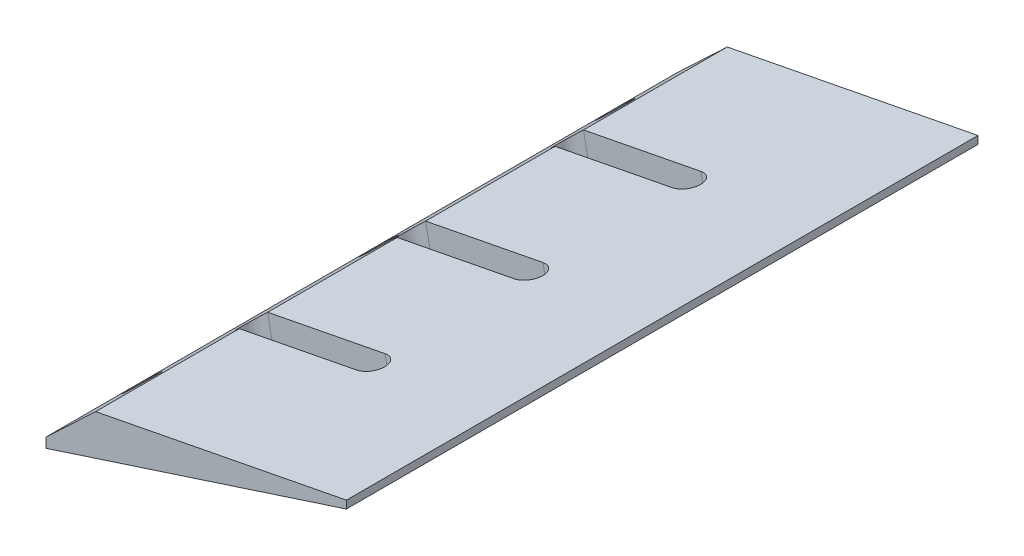
ISO-10303-21;
HEADER;
FILE_DESCRIPTION(('STEP AP214'),'2;1');
FILE_NAME('part.step','',(''),(''),'','','');
FILE_SCHEMA(('AUTOMOTIVE_DESIGN { 1 0 10303 214 1 1 1 1 }'));
ENDSEC;
DATA;
#1=APPLICATION_CONTEXT('core data for automotive mechanical design processes');
#2=APPLICATION_PROTOCOL_DEFINITION('international standard','automotive_design',2000,#1);
#3=PRODUCT_CONTEXT('',#1,'mechanical');
#4=PRODUCT('Part','Part','',(#3));
#5=PRODUCT_RELATED_PRODUCT_CATEGORY('part','',(#4));
#6=PRODUCT_DEFINITION_FORMATION('','',#4);
#7=PRODUCT_DEFINITION_CONTEXT('part definition',#1,'design');
#8=PRODUCT_DEFINITION('design','',#6,#7);
#9=PRODUCT_DEFINITION_SHAPE('','',#8);
#10=(LENGTH_UNIT() NAMED_UNIT(*) SI_UNIT(.MILLI.,.METRE.));
#11=(NAMED_UNIT(*) PLANE_ANGLE_UNIT() SI_UNIT($,.RADIAN.));
#12=(NAMED_UNIT(*) SI_UNIT($,.STERADIAN.) SOLID_ANGLE_UNIT());
#13=UNCERTAINTY_MEASURE_WITH_UNIT(LENGTH_MEASURE(1.E-05),#10,'distance_accuracy_value','');
#14=(GEOMETRIC_REPRESENTATION_CONTEXT(3) GLOBAL_UNCERTAINTY_ASSIGNED_CONTEXT((#13)) GLOBAL_UNIT_ASSIGNED_CONTEXT((#10,
#11,#12)) REPRESENTATION_CONTEXT('',''));
#15=CARTESIAN_POINT('',(0.,0.,0.));
#16=DIRECTION('',(0.,0.,1.));
#17=DIRECTION('',(1.,0.,0.));
#18=AXIS2_PLACEMENT_3D('',#15,#16,#17);
#19=CARTESIAN_POINT('',(-76.2297436243775,-55.6702445798386,140.));
#20=DIRECTION('',(-0.309016994374941,0.951056516295156,0.));
#21=DIRECTION('',(-0.951056516295156,-0.309016994374941,0.));
#22=AXIS2_PLACEMENT_3D('',#19,#20,#21);
#23=CYLINDRICAL_SURFACE('',#22,1.5);
#24=CARTESIAN_POINT('',(-85.3115252244442,-27.7193948610917,140.));
#25=DIRECTION('',(-0.309016994374941,0.951056516295156,0.));
#26=DIRECTION('',(-0.951056516295156,-0.309016994374941,0.));
#27=AXIS2_PLACEMENT_3D('',#24,#25,#26);
#28=CIRCLE('',#27,1.5);
#29=CARTESIAN_POINT('',(-86.7381099988869,-28.1829203526541,140.));
#30=VERTEX_POINT('',#29);
#31=EDGE_CURVE('E226',#30,#30,#28,.T.);
#32=ORIENTED_EDGE('',*,*,#31,.F.);
#33=EDGE_LOOP('',(#32));
#34=FACE_BOUND('',#33,.T.);
#35=CARTESIAN_POINT('',(-85.9295592131941,-25.8172818285014,140.));
#36=DIRECTION('',(-0.309016994374941,0.951056516295156,0.));
#37=DIRECTION('',(-0.951056516295156,-0.309016994374941,0.));
#38=AXIS2_PLACEMENT_3D('',#35,#36,#37);
#39=CIRCLE('',#38,1.5);
#40=CARTESIAN_POINT('',(-87.3561439876368,-26.2808073200638,140.));
#41=VERTEX_POINT('',#40);
#42=EDGE_CURVE('E210',#41,#41,#39,.F.);
#43=ORIENTED_EDGE('',*,*,#42,.F.);
#44=EDGE_LOOP('',(#43));
#45=FACE_BOUND('',#44,.T.);
#46=ADVANCED_FACE('F40',(#34,#45),#23,.F.);
#47=CARTESIAN_POINT('',(-76.2297436243767,-55.6702445798384,80.));
#48=DIRECTION('',(-0.309016994374941,0.951056516295156,0.));
#49=DIRECTION('',(-0.951056516295156,-0.309016994374941,0.));
#50=AXIS2_PLACEMENT_3D('',#47,#48,#49);
#51=CYLINDRICAL_SURFACE('',#50,1.5);
#52=CARTESIAN_POINT('',(-85.3115252244433,-27.7193948610914,80.));
#53=DIRECTION('',(-0.309016994374941,0.951056516295156,0.));
#54=DIRECTION('',(-0.951056516295156,-0.309016994374941,0.));
#55=AXIS2_PLACEMENT_3D('',#52,#53,#54);
#56=CIRCLE('',#55,1.5);
#57=CARTESIAN_POINT('',(-86.738109998886,-28.1829203526538,80.));
#58=VERTEX_POINT('',#57);
#59=EDGE_CURVE('E186',#58,#58,#56,.T.);
#60=ORIENTED_EDGE('',*,*,#59,.F.);
#61=EDGE_LOOP('',(#60));
#62=FACE_BOUND('',#61,.T.);
#63=CARTESIAN_POINT('',(-85.9295592131932,-25.8172818285011,80.));
#64=DIRECTION('',(-0.309016994374941,0.951056516295156,0.));
#65=DIRECTION('',(-0.951056516295156,-0.309016994374941,0.));
#66=AXIS2_PLACEMENT_3D('',#63,#64,#65);
#67=CIRCLE('',#66,1.5);
#68=CARTESIAN_POINT('',(-87.3561439876359,-26.2808073200635,80.));
#69=VERTEX_POINT('',#68);
#70=EDGE_CURVE('E205',#69,#69,#67,.F.);
#71=ORIENTED_EDGE('',*,*,#70,.F.);
#72=EDGE_LOOP('',(#71));
#73=FACE_BOUND('',#72,.T.);
#74=ADVANCED_FACE('F467',(#62,#73),#51,.F.);
#75=CARTESIAN_POINT('',(-76.2297436243775,-55.6702445798386,20.));
#76=DIRECTION('',(-0.309016994374941,0.951056516295156,0.));
#77=DIRECTION('',(-0.951056516295156,-0.309016994374941,0.));
#78=AXIS2_PLACEMENT_3D('',#75,#76,#77);
#79=CYLINDRICAL_SURFACE('',#78,1.5);
#80=CARTESIAN_POINT('',(-85.3115252244442,-27.7193948610917,20.));
#81=DIRECTION('',(-0.309016994374941,0.951056516295156,0.));
#82=DIRECTION('',(-0.951056516295156,-0.309016994374941,0.));
#83=AXIS2_PLACEMENT_3D('',#80,#81,#82);
#84=CIRCLE('',#83,1.5);
#85=CARTESIAN_POINT('',(-86.7381099988869,-28.1829203526541,20.));
#86=VERTEX_POINT('',#85);
#87=EDGE_CURVE('E179',#86,#86,#84,.T.);
#88=ORIENTED_EDGE('',*,*,#87,.F.);
#89=EDGE_LOOP('',(#88));
#90=FACE_BOUND('',#89,.T.);
#91=CARTESIAN_POINT('',(-85.9295592131941,-25.8172818285014,20.));
#92=DIRECTION('',(-0.309016994374941,0.951056516295156,0.));
#93=DIRECTION('',(-0.951056516295156,-0.309016994374941,0.));
#94=AXIS2_PLACEMENT_3D('',#91,#92,#93);
#95=CIRCLE('',#94,1.5);
#96=CARTESIAN_POINT('',(-87.3561439876368,-26.2808073200638,20.));
#97=VERTEX_POINT('',#96);
#98=EDGE_CURVE('E201',#97,#97,#95,.F.);
#99=ORIENTED_EDGE('',*,*,#98,.F.);
#100=EDGE_LOOP('',(#99));
#101=FACE_BOUND('',#100,.T.);
#102=ADVANCED_FACE('F462',(#90,#101),#79,.F.);
#103=CARTESIAN_POINT('',(0.,0.,160.));
#104=DIRECTION('',(-0.309016994374941,0.951056516295156,0.));
#105=DIRECTION('',(-0.951056516295156,-0.309016994374941,0.));
#106=AXIS2_PLACEMENT_3D('',#103,#104,#105);
#107=PLANE('',#106);
#108=DIRECTION('',(0.951056516295156,0.309016994374941,0.));
#109=VECTOR('',#108,1.);
#110=CARTESIAN_POINT('',(0.,0.,123.6));
#111=LINE('',#110,#109);
#112=CARTESIAN_POINT('',(-76.6559027787226,-24.9070126453212,123.6));
#113=VERTEX_POINT('',#112);
#114=CARTESIAN_POINT('',(-47.6424429134042,-15.4799680792165,123.6));
#115=VERTEX_POINT('',#114);
#116=EDGE_CURVE('E359',#113,#115,#111,.T.);
#117=ORIENTED_EDGE('',*,*,#116,.T.);
#118=CARTESIAN_POINT('',(-47.6424429134042,-15.4799680792165,120.));
#119=DIRECTION('',(-0.309016994374941,0.951056516295156,0.));
#120=DIRECTION('',(0.951056516295156,0.309016994374941,0.));
#121=AXIS2_PLACEMENT_3D('',#118,#119,#120);
#122=ELLIPSE('',#121,3.62703537165186,3.60000000000001);
#123=CARTESIAN_POINT('',(-47.6424429134042,-15.4799680792165,116.4));
#124=VERTEX_POINT('',#123);
#125=EDGE_CURVE('E371',#115,#124,#122,.T.);
#126=ORIENTED_EDGE('',*,*,#125,.T.);
#127=DIRECTION('',(-0.951056516295156,-0.309016994374941,0.));
#128=VECTOR('',#127,1.);
#129=CARTESIAN_POINT('',(0.,0.,116.4));
#130=LINE('',#129,#128);
#131=CARTESIAN_POINT('',(-76.6559027787226,-24.9070126453212,116.4));
#132=VERTEX_POINT('',#131);
#133=EDGE_CURVE('E270',#124,#132,#130,.T.);
#134=ORIENTED_EDGE('',*,*,#133,.T.);
#135=CARTESIAN_POINT('',(-76.6559027787226,-24.9070126453212,120.));
#136=DIRECTION('',(-0.309016994374941,0.951056516295156,0.));
#137=DIRECTION('',(0.951056516295156,0.309016994374941,0.));
#138=AXIS2_PLACEMENT_3D('',#135,#136,#137);
#139=ELLIPSE('',#138,3.62703537165186,3.60000000000001);
#140=EDGE_CURVE('E353',#132,#113,#139,.T.);
#141=ORIENTED_EDGE('',*,*,#140,.T.);
#142=EDGE_LOOP('',(#117,#126,#134,#141));
#143=FACE_BOUND('',#142,.T.);
#144=DIRECTION('',(0.951056516295156,0.309016994374941,0.));
#145=VECTOR('',#144,1.);
#146=CARTESIAN_POINT('',(0.,0.,83.6));
#147=LINE('',#146,#145);
#148=CARTESIAN_POINT('',(-76.6559027787226,-24.9070126453212,83.5999999999999));
#149=VERTEX_POINT('',#148);
#150=CARTESIAN_POINT('',(-47.6424429134042,-15.4799680792165,83.5999999999999));
#151=VERTEX_POINT('',#150);
#152=EDGE_CURVE('E345',#149,#151,#147,.T.);
#153=ORIENTED_EDGE('',*,*,#152,.T.);
#154=CARTESIAN_POINT('',(-47.6424429134042,-15.4799680792165,79.9999999999999));
#155=DIRECTION('',(-0.309016994374941,0.951056516295156,0.));
#156=DIRECTION('',(0.951056516295156,0.309016994374941,0.));
#157=AXIS2_PLACEMENT_3D('',#154,#155,#156);
#158=ELLIPSE('',#157,3.62703537165186,3.60000000000001);
#159=CARTESIAN_POINT('',(-47.6424429134042,-15.4799680792165,76.3999999999999));
#160=VERTEX_POINT('',#159);
#161=EDGE_CURVE('E367',#151,#160,#158,.T.);
#162=ORIENTED_EDGE('',*,*,#161,.T.);
#163=DIRECTION('',(-0.951056516295156,-0.309016994374941,0.));
#164=VECTOR('',#163,1.);
#165=CARTESIAN_POINT('',(0.,0.,76.3999999999999));
#166=LINE('',#165,#164);
#167=CARTESIAN_POINT('',(-76.6559027787226,-24.9070126453212,76.3999999999999));
#168=VERTEX_POINT('',#167);
#169=EDGE_CURVE('E333',#160,#168,#166,.T.);
#170=ORIENTED_EDGE('',*,*,#169,.T.);
#171=CARTESIAN_POINT('',(-76.6559027787226,-24.9070126453212,79.9999999999999));
#172=DIRECTION('',(-0.309016994374941,0.951056516295156,0.));
#173=DIRECTION('',(0.951056516295156,0.309016994374941,0.));
#174=AXIS2_PLACEMENT_3D('',#171,#172,#173);
#175=ELLIPSE('',#174,3.62703537165184,3.59999999999999);
#176=EDGE_CURVE('E337',#168,#149,#175,.T.);
#177=ORIENTED_EDGE('',*,*,#176,.T.);
#178=EDGE_LOOP('',(#153,#162,#170,#177));
#179=FACE_BOUND('',#178,.T.);
#180=DIRECTION('',(0.951056516295156,0.309016994374941,0.));
#181=VECTOR('',#180,1.);
#182=CARTESIAN_POINT('',(0.,0.,43.5999999999999));
#183=LINE('',#182,#181);
#184=CARTESIAN_POINT('',(-76.6559027787226,-24.9070126453212,43.5999999999999));
#185=VERTEX_POINT('',#184);
#186=CARTESIAN_POINT('',(-47.6424429134042,-15.4799680792165,43.5999999999999));
#187=VERTEX_POINT('',#186);
#188=EDGE_CURVE('E325',#185,#187,#183,.T.);
#189=ORIENTED_EDGE('',*,*,#188,.T.);
#190=CARTESIAN_POINT('',(-47.6424429134042,-15.4799680792165,39.9999999999999));
#191=DIRECTION('',(-0.309016994374941,0.951056516295156,0.));
#192=DIRECTION('',(0.951056516295156,0.309016994374941,0.));
#193=AXIS2_PLACEMENT_3D('',#190,#191,#192);
#194=ELLIPSE('',#193,3.62703537165185,3.6);
#195=CARTESIAN_POINT('',(-47.6424429134042,-15.4799680792165,36.3999999999999));
#196=VERTEX_POINT('',#195);
#197=EDGE_CURVE('E363',#187,#196,#194,.T.);
#198=ORIENTED_EDGE('',*,*,#197,.T.);
#199=DIRECTION('',(-0.951056516295156,-0.309016994374941,0.));
#200=VECTOR('',#199,1.);
#201=CARTESIAN_POINT('',(1.60425387771917E-13,0.,36.4));
#202=LINE('',#201,#200);
#203=CARTESIAN_POINT('',(-76.6559027787226,-24.9070126453212,36.3999999999999));
#204=VERTEX_POINT('',#203);
#205=EDGE_CURVE('E313',#196,#204,#202,.T.);
#206=ORIENTED_EDGE('',*,*,#205,.T.);
#207=CARTESIAN_POINT('',(-76.6559027787226,-24.9070126453212,39.9999999999999));
#208=DIRECTION('',(-0.309016994374941,0.951056516295156,0.));
#209=DIRECTION('',(0.951056516295156,0.309016994374941,0.));
#210=AXIS2_PLACEMENT_3D('',#207,#208,#209);
#211=ELLIPSE('',#210,3.62703537165187,3.60000000000002);
#212=EDGE_CURVE('E317',#204,#185,#211,.T.);
#213=ORIENTED_EDGE('',*,*,#212,.T.);
#214=EDGE_LOOP('',(#189,#198,#206,#213));
#215=FACE_BOUND('',#214,.T.);
#216=ORIENTED_EDGE('',*,*,#87,.T.);
#217=EDGE_LOOP('',(#216));
#218=FACE_BOUND('',#217,.T.);
#219=ORIENTED_EDGE('',*,*,#59,.T.);
#220=EDGE_LOOP('',(#219));
#221=FACE_BOUND('',#220,.T.);
#222=ORIENTED_EDGE('',*,*,#31,.T.);
#223=EDGE_LOOP('',(#222));
#224=FACE_BOUND('',#223,.T.);
#225=DIRECTION('',(0.951056516295156,0.309016994374941,0.));
#226=VECTOR('',#225,1.);
#227=CARTESIAN_POINT('',(0.,0.,0.));
#228=LINE('',#227,#226);
#229=CARTESIAN_POINT('',(-91.1056516295156,-29.6020206525625,0.));
#230=VERTEX_POINT('',#229);
#231=CARTESIAN_POINT('',(-15.,-4.87379544349349,0.));
#232=VERTEX_POINT('',#231);
#233=EDGE_CURVE('E169',#230,#232,#228,.T.);
#234=ORIENTED_EDGE('',*,*,#233,.T.);
#235=DIRECTION('',(0.,0.,1.));
#236=VECTOR('',#235,1.);
#237=CARTESIAN_POINT('',(-15.,-4.87379544349348,160.));
#238=LINE('',#237,#236);
#239=CARTESIAN_POINT('',(-15.,-4.87379544349349,160.));
#240=VERTEX_POINT('',#239);
#241=EDGE_CURVE('E63',#232,#240,#238,.T.);
#242=ORIENTED_EDGE('',*,*,#241,.T.);
#243=DIRECTION('',(0.951056516295156,0.309016994374941,0.));
#244=VECTOR('',#243,1.);
#245=CARTESIAN_POINT('',(0.,0.,160.));
#246=LINE('',#245,#244);
#247=CARTESIAN_POINT('',(-91.1056516295156,-29.6020206525625,160.));
#248=VERTEX_POINT('',#247);
#249=EDGE_CURVE('E171',#248,#240,#246,.T.);
#250=ORIENTED_EDGE('',*,*,#249,.F.);
#251=DIRECTION('',(0.,0.,-1.));
#252=VECTOR('',#251,1.);
#253=CARTESIAN_POINT('',(-91.1056516295156,-29.6020206525625,160.));
#254=LINE('',#253,#252);
#255=EDGE_CURVE('E158',#248,#230,#254,.T.);
#256=ORIENTED_EDGE('',*,*,#255,.T.);
#257=EDGE_LOOP('',(#234,#242,#250,#256));
#258=FACE_BOUND('',#257,.T.);
#259=ADVANCED_FACE('F42',(#143,#179,#215,#218,#221,#224,#258),#107,.F.);
#260=CARTESIAN_POINT('',(0.,0.,160.));
#261=DIRECTION('',(0.190808995376542,-0.981627183447665,0.));
#262=DIRECTION('',(0.981627183447665,0.190808995376542,0.));
#263=AXIS2_PLACEMENT_3D('',#260,#261,#262);
#264=PLANE('',#263);
#265=DIRECTION('',(-0.981627183447665,-0.190808995376542,0.));
#266=VECTOR('',#265,1.);
#267=CARTESIAN_POINT('',(0.,0.,160.));
#268=LINE('',#267,#266);
#269=CARTESIAN_POINT('',(-15.,-2.91570463706573,160.));
#270=VERTEX_POINT('',#269);
#271=CARTESIAN_POINT('',(-78.5301746758131,-15.2647196301234,160.));
#272=VERTEX_POINT('',#271);
#273=EDGE_CURVE('E392',#270,#272,#268,.T.);
#274=ORIENTED_EDGE('',*,*,#273,.F.);
#275=DIRECTION('',(0.,0.,-1.));
#276=VECTOR('',#275,1.);
#277=CARTESIAN_POINT('',(-15.,-2.91570463706573,160.));
#278=LINE('',#277,#276);
#279=CARTESIAN_POINT('',(-15.,-2.91570463706573,0.));
#280=VERTEX_POINT('',#279);
#281=EDGE_CURVE('E438',#270,#280,#278,.T.);
#282=ORIENTED_EDGE('',*,*,#281,.T.);
#283=DIRECTION('',(-0.981627183447665,-0.190808995376542,0.));
#284=VECTOR('',#283,1.);
#285=CARTESIAN_POINT('',(0.,0.,0.));
#286=LINE('',#285,#284);
#287=CARTESIAN_POINT('',(-78.5301746758131,-15.2647196301234,0.));
#288=VERTEX_POINT('',#287);
#289=EDGE_CURVE('E178',#280,#288,#286,.T.);
#290=ORIENTED_EDGE('',*,*,#289,.T.);
#291=DIRECTION('',(0.,0.,-1.));
#292=VECTOR('',#291,1.);
#293=CARTESIAN_POINT('',(-78.5301746758131,-15.2647196301234,160.));
#294=LINE('',#293,#292);
#295=CARTESIAN_POINT('',(-78.5301746758131,-15.2647196301234,36.3999999999999));
#296=VERTEX_POINT('',#295);
#297=EDGE_CURVE('E200',#296,#288,#294,.T.);
#298=ORIENTED_EDGE('',*,*,#297,.F.);
#299=DIRECTION('',(0.981627183447665,0.190808995376542,0.));
#300=VECTOR('',#299,1.);
#301=CARTESIAN_POINT('',(1.66825578225979E-13,0.,36.4));
#302=LINE('',#301,#300);
#303=CARTESIAN_POINT('',(-48.8073224415874,-9.48718242437991,36.3999999999999));
#304=VERTEX_POINT('',#303);
#305=EDGE_CURVE('E309',#296,#304,#302,.T.);
#306=ORIENTED_EDGE('',*,*,#305,.T.);
#307=CARTESIAN_POINT('',(-48.8073224415874,-9.48718242437991,39.9999999999999));
#308=DIRECTION('',(0.190808995376542,-0.981627183447665,0.));
#309=DIRECTION('',(0.981627183447665,0.190808995376542,0.));
#310=AXIS2_PLACEMENT_3D('',#307,#308,#309);
#311=CIRCLE('',#310,3.6);
#312=CARTESIAN_POINT('',(-48.8073224415874,-9.48718242437991,43.5999999999999));
#313=VERTEX_POINT('',#312);
#314=EDGE_CURVE('E238',#304,#313,#311,.T.);
#315=ORIENTED_EDGE('',*,*,#314,.T.);
#316=DIRECTION('',(-0.981627183447665,-0.190808995376542,0.));
#317=VECTOR('',#316,1.);
#318=CARTESIAN_POINT('',(0.,0.,43.5999999999999));
#319=LINE('',#318,#317);
#320=CARTESIAN_POINT('',(-78.5301746758131,-15.2647196301234,43.5999999999999));
#321=VERTEX_POINT('',#320);
#322=EDGE_CURVE('E321',#313,#321,#319,.T.);
#323=ORIENTED_EDGE('',*,*,#322,.T.);
#324=CARTESIAN_POINT('',(-78.5301746758131,-15.2647196301234,76.3999999999999));
#325=VERTEX_POINT('',#324);
#326=EDGE_CURVE('E401',#325,#321,#294,.T.);
#327=ORIENTED_EDGE('',*,*,#326,.F.);
#328=DIRECTION('',(0.981627183447665,0.190808995376542,0.));
#329=VECTOR('',#328,1.);
#330=CARTESIAN_POINT('',(0.,0.,76.3999999999999));
#331=LINE('',#330,#329);
#332=CARTESIAN_POINT('',(-48.8073224415874,-9.48718242437991,76.3999999999999));
#333=VERTEX_POINT('',#332);
#334=EDGE_CURVE('E329',#325,#333,#331,.T.);
#335=ORIENTED_EDGE('',*,*,#334,.T.);
#336=CARTESIAN_POINT('',(-48.8073224415874,-9.48718242437991,79.9999999999999));
#337=DIRECTION('',(0.190808995376542,-0.981627183447665,0.));
#338=DIRECTION('',(0.981627183447665,0.190808995376542,0.));
#339=AXIS2_PLACEMENT_3D('',#336,#337,#338);
#340=CIRCLE('',#339,3.60000000000001);
#341=CARTESIAN_POINT('',(-48.8073224415874,-9.48718242437991,83.5999999999999));
#342=VERTEX_POINT('',#341);
#343=EDGE_CURVE('E242',#333,#342,#340,.T.);
#344=ORIENTED_EDGE('',*,*,#343,.T.);
#345=DIRECTION('',(-0.981627183447665,-0.190808995376542,0.));
#346=VECTOR('',#345,1.);
#347=CARTESIAN_POINT('',(0.,0.,83.6));
#348=LINE('',#347,#346);
#349=CARTESIAN_POINT('',(-78.5301746758131,-15.2647196301234,83.5999999999999));
#350=VERTEX_POINT('',#349);
#351=EDGE_CURVE('E341',#342,#350,#348,.T.);
#352=ORIENTED_EDGE('',*,*,#351,.T.);
#353=CARTESIAN_POINT('',(-78.5301746758131,-15.2647196301234,116.4));
#354=VERTEX_POINT('',#353);
#355=EDGE_CURVE('E199',#354,#350,#294,.T.);
#356=ORIENTED_EDGE('',*,*,#355,.F.);
#357=DIRECTION('',(0.981627183447665,0.190808995376542,0.));
#358=VECTOR('',#357,1.);
#359=CARTESIAN_POINT('',(0.,0.,116.4));
#360=LINE('',#359,#358);
#361=CARTESIAN_POINT('',(-48.8073224415874,-9.48718242437991,116.4));
#362=VERTEX_POINT('',#361);
#363=EDGE_CURVE('E257',#354,#362,#360,.T.);
#364=ORIENTED_EDGE('',*,*,#363,.T.);
#365=CARTESIAN_POINT('',(-48.8073224415874,-9.48718242437991,120.));
#366=DIRECTION('',(0.190808995376542,-0.981627183447665,0.));
#367=DIRECTION('',(0.981627183447665,0.190808995376542,0.));
#368=AXIS2_PLACEMENT_3D('',#365,#366,#367);
#369=CIRCLE('',#368,3.60000000000001);
#370=CARTESIAN_POINT('',(-48.8073224415874,-9.48718242437991,123.6));
#371=VERTEX_POINT('',#370);
#372=EDGE_CURVE('E165',#362,#371,#369,.T.);
#373=ORIENTED_EDGE('',*,*,#372,.T.);
#374=DIRECTION('',(-0.981627183447665,-0.190808995376542,0.));
#375=VECTOR('',#374,1.);
#376=CARTESIAN_POINT('',(0.,0.,123.6));
#377=LINE('',#376,#375);
#378=CARTESIAN_POINT('',(-78.5301746758131,-15.2647196301234,123.6));
#379=VERTEX_POINT('',#378);
#380=EDGE_CURVE('E254',#371,#379,#377,.T.);
#381=ORIENTED_EDGE('',*,*,#380,.T.);
#382=EDGE_CURVE('E194',#272,#379,#294,.T.);
#383=ORIENTED_EDGE('',*,*,#382,.F.);
#384=EDGE_LOOP('',(#274,#282,#290,#298,#306,#315,#323,#327,#335,#344,#352,#356,#364,#373,#381,#383));
#385=FACE_BOUND('',#384,.T.);
#386=ADVANCED_FACE('F252',(#385),#264,.F.);
#387=CARTESIAN_POINT('',(-95.1056516295156,-30.9016994374941,160.));
#388=DIRECTION('',(0.686214329486992,-0.727399404733547,0.));
#389=DIRECTION('',(0.727399404733547,0.686214329486992,0.));
#390=AXIS2_PLACEMENT_3D('',#387,#388,#389);
#391=PLANE('',#390);
#392=CARTESIAN_POINT('',(-86.8179131526644,-23.0832095338088,20.));
#393=DIRECTION('',(0.686214329486992,-0.727399404733547,0.));
#394=DIRECTION('',(0.727399404733547,0.686214329486992,0.));
#395=AXIS2_PLACEMENT_3D('',#392,#393,#394);
#396=ELLIPSE('',#395,4.42551389856633,4.);
#397=CARTESIAN_POINT('',(-83.5987969772072,-20.0463584812687,20.));
#398=VERTEX_POINT('',#397);
#399=EDGE_CURVE('E222',#398,#398,#396,.T.);
#400=ORIENTED_EDGE('',*,*,#399,.T.);
#401=EDGE_LOOP('',(#400));
#402=FACE_BOUND('',#401,.T.);
#403=CARTESIAN_POINT('',(-86.8179131526636,-23.0832095338081,80.));
#404=DIRECTION('',(0.686214329486992,-0.727399404733547,0.));
#405=DIRECTION('',(0.727399404733547,0.686214329486992,0.));
#406=AXIS2_PLACEMENT_3D('',#403,#404,#405);
#407=ELLIPSE('',#406,4.42551389856633,4.00000000000001);
#408=CARTESIAN_POINT('',(-83.5987969772065,-20.046358481268,80.));
#409=VERTEX_POINT('',#408);
#410=EDGE_CURVE('E218',#409,#409,#407,.T.);
#411=ORIENTED_EDGE('',*,*,#410,.T.);
#412=EDGE_LOOP('',(#411));
#413=FACE_BOUND('',#412,.T.);
#414=CARTESIAN_POINT('',(-86.8179131526644,-23.0832095338088,140.));
#415=DIRECTION('',(0.686214329486992,-0.727399404733547,0.));
#416=DIRECTION('',(0.727399404733547,0.686214329486992,0.));
#417=AXIS2_PLACEMENT_3D('',#414,#415,#416);
#418=ELLIPSE('',#417,4.42551389856633,4.);
#419=CARTESIAN_POINT('',(-83.5987969772072,-20.0463584812687,140.));
#420=VERTEX_POINT('',#419);
#421=EDGE_CURVE('E214',#420,#420,#418,.T.);
#422=ORIENTED_EDGE('',*,*,#421,.T.);
#423=EDGE_LOOP('',(#422));
#424=FACE_BOUND('',#423,.T.);
#425=DIRECTION('',(-0.727399404733547,-0.686214329486992,0.));
#426=VECTOR('',#425,1.);
#427=CARTESIAN_POINT('',(-95.1056516295156,-30.9016994374941,0.));
#428=LINE('',#427,#426);
#429=CARTESIAN_POINT('',(-91.1056516295156,-27.1281779029894,0.));
#430=VERTEX_POINT('',#429);
#431=EDGE_CURVE('E183',#288,#430,#428,.T.);
#432=ORIENTED_EDGE('',*,*,#431,.T.);
#433=DIRECTION('',(0.,0.,1.));
#434=VECTOR('',#433,1.);
#435=CARTESIAN_POINT('',(-91.1056516295156,-27.1281779029894,160.));
#436=LINE('',#435,#434);
#437=CARTESIAN_POINT('',(-91.1056516295156,-27.1281779029894,160.));
#438=VERTEX_POINT('',#437);
#439=EDGE_CURVE('E56',#430,#438,#436,.T.);
#440=ORIENTED_EDGE('',*,*,#439,.T.);
#441=DIRECTION('',(-0.727399404733547,-0.686214329486992,0.));
#442=VECTOR('',#441,1.);
#443=CARTESIAN_POINT('',(-95.1056516295156,-30.9016994374941,160.));
#444=LINE('',#443,#442);
#445=EDGE_CURVE('E189',#272,#438,#444,.T.);
#446=ORIENTED_EDGE('',*,*,#445,.F.);
#447=ORIENTED_EDGE('',*,*,#382,.T.);
#448=CARTESIAN_POINT('',(-78.5301746758131,-15.2647196301234,120.));
#449=DIRECTION('',(0.686214329486992,-0.727399404733547,0.));
#450=DIRECTION('',(0.727399404733547,0.686214329486992,0.));
#451=AXIS2_PLACEMENT_3D('',#448,#449,#450);
#452=ELLIPSE('',#451,4.26050177370806,3.60000000000001);
#453=EDGE_CURVE('E234',#379,#354,#452,.T.);
#454=ORIENTED_EDGE('',*,*,#453,.T.);
#455=ORIENTED_EDGE('',*,*,#355,.T.);
#456=CARTESIAN_POINT('',(-78.5301746758131,-15.2647196301234,79.9999999999999));
#457=DIRECTION('',(0.686214329486992,-0.727399404733547,0.));
#458=DIRECTION('',(0.727399404733547,0.686214329486992,0.));
#459=AXIS2_PLACEMENT_3D('',#456,#457,#458);
#460=ELLIPSE('',#459,4.26050177370805,3.59999999999999);
#461=EDGE_CURVE('E230',#350,#325,#460,.T.);
#462=ORIENTED_EDGE('',*,*,#461,.T.);
#463=ORIENTED_EDGE('',*,*,#326,.T.);
#464=CARTESIAN_POINT('',(-78.5301746758131,-15.2647196301234,39.9999999999999));
#465=DIRECTION('',(0.686214329486992,-0.727399404733547,0.));
#466=DIRECTION('',(0.727399404733547,0.686214329486992,0.));
#467=AXIS2_PLACEMENT_3D('',#464,#465,#466);
#468=ELLIPSE('',#467,4.26050177370808,3.60000000000002);
#469=EDGE_CURVE('E198',#321,#296,#468,.T.);
#470=ORIENTED_EDGE('',*,*,#469,.T.);
#471=ORIENTED_EDGE('',*,*,#297,.T.);
#472=EDGE_LOOP('',(#432,#440,#446,#447,#454,#455,#462,#463,#470,#471));
#473=FACE_BOUND('',#472,.T.);
#474=ADVANCED_FACE('F409',(#402,#413,#424,#473),#391,.F.);
#475=CARTESIAN_POINT('',(0.,0.,160.));
#476=DIRECTION('',(0.,0.,-1.));
#477=DIRECTION('',(-1.,0.,0.));
#478=AXIS2_PLACEMENT_3D('',#475,#476,#477);
#479=PLANE('',#478);
#480=ORIENTED_EDGE('',*,*,#249,.T.);
#481=DIRECTION('',(0.,1.,0.));
#482=VECTOR('',#481,1.);
#483=CARTESIAN_POINT('',(-15.,0.,160.));
#484=LINE('',#483,#482);
#485=EDGE_CURVE('E173',#240,#270,#484,.T.);
#486=ORIENTED_EDGE('',*,*,#485,.T.);
#487=ORIENTED_EDGE('',*,*,#273,.T.);
#488=ORIENTED_EDGE('',*,*,#445,.T.);
#489=DIRECTION('',(0.,-1.,0.));
#490=VECTOR('',#489,1.);
#491=CARTESIAN_POINT('',(-91.1056516295156,0.,160.));
#492=LINE('',#491,#490);
#493=EDGE_CURVE('E440',#438,#248,#492,.T.);
#494=ORIENTED_EDGE('',*,*,#493,.T.);
#495=EDGE_LOOP('',(#480,#486,#487,#488,#494));
#496=FACE_BOUND('',#495,.T.);
#497=ADVANCED_FACE('F481',(#496),#479,.F.);
#498=CARTESIAN_POINT('',(0.,0.,0.));
#499=DIRECTION('',(0.,0.,-1.));
#500=DIRECTION('',(-1.,0.,0.));
#501=AXIS2_PLACEMENT_3D('',#498,#499,#500);
#502=PLANE('',#501);
#503=DIRECTION('',(0.,1.,0.));
#504=VECTOR('',#503,1.);
#505=CARTESIAN_POINT('',(-15.,0.,0.));
#506=LINE('',#505,#504);
#507=EDGE_CURVE('E11',#232,#280,#506,.T.);
#508=ORIENTED_EDGE('',*,*,#507,.F.);
#509=ORIENTED_EDGE('',*,*,#233,.F.);
#510=DIRECTION('',(0.,-1.,0.));
#511=VECTOR('',#510,1.);
#512=CARTESIAN_POINT('',(-91.1056516295156,0.,0.));
#513=LINE('',#512,#511);
#514=EDGE_CURVE('E49',#430,#230,#513,.T.);
#515=ORIENTED_EDGE('',*,*,#514,.F.);
#516=ORIENTED_EDGE('',*,*,#431,.F.);
#517=ORIENTED_EDGE('',*,*,#289,.F.);
#518=EDGE_LOOP('',(#508,#509,#515,#516,#517));
#519=FACE_BOUND('',#518,.T.);
#520=ADVANCED_FACE('F175',(#519),#502,.T.);
#521=CARTESIAN_POINT('',(-85.9295592131941,-25.8172818285014,20.));
#522=DIRECTION('',(-0.309016994374941,0.951056516295156,0.));
#523=DIRECTION('',(-0.951056516295156,-0.309016994374941,0.));
#524=AXIS2_PLACEMENT_3D('',#521,#522,#523);
#525=CYLINDRICAL_SURFACE('',#524,4.);
#526=CARTESIAN_POINT('',(-85.9295592131941,-25.8172818285014,20.));
#527=DIRECTION('',(-0.309016994374941,0.951056516295156,0.));
#528=DIRECTION('',(-0.951056516295156,-0.309016994374941,0.));
#529=AXIS2_PLACEMENT_3D('',#526,#527,#528);
#530=CIRCLE('',#529,4.);
#531=CARTESIAN_POINT('',(-89.7337852783747,-27.0533498060012,20.));
#532=VERTEX_POINT('',#531);
#533=EDGE_CURVE('E206',#532,#532,#530,.T.);
#534=ORIENTED_EDGE('',*,*,#533,.F.);
#535=EDGE_LOOP('',(#534));
#536=FACE_BOUND('',#535,.T.);
#537=ORIENTED_EDGE('',*,*,#399,.F.);
#538=EDGE_LOOP('',(#537));
#539=FACE_BOUND('',#538,.T.);
#540=ADVANCED_FACE('F486',(#536,#539),#525,.F.);
#541=CARTESIAN_POINT('',(-85.9295592131941,-25.8172818285014,20.));
#542=DIRECTION('',(-0.309016994374941,0.951056516295156,0.));
#543=DIRECTION('',(-0.951056516295156,-0.309016994374941,0.));
#544=AXIS2_PLACEMENT_3D('',#541,#542,#543);
#545=PLANE('',#544);
#546=ORIENTED_EDGE('',*,*,#533,.T.);
#547=EDGE_LOOP('',(#546));
#548=FACE_BOUND('',#547,.T.);
#549=ORIENTED_EDGE('',*,*,#98,.T.);
#550=EDGE_LOOP('',(#549));
#551=FACE_BOUND('',#550,.T.);
#552=ADVANCED_FACE('F515',(#548,#551),#545,.T.);
#553=CARTESIAN_POINT('',(-85.9295592131932,-25.8172818285011,80.));
#554=DIRECTION('',(-0.309016994374941,0.951056516295156,0.));
#555=DIRECTION('',(-0.951056516295156,-0.309016994374941,0.));
#556=AXIS2_PLACEMENT_3D('',#553,#554,#555);
#557=CYLINDRICAL_SURFACE('',#556,4.00000000000001);
#558=CARTESIAN_POINT('',(-85.9295592131932,-25.8172818285011,80.));
#559=DIRECTION('',(-0.309016994374941,0.951056516295156,0.));
#560=DIRECTION('',(-0.951056516295156,-0.309016994374941,0.));
#561=AXIS2_PLACEMENT_3D('',#558,#559,#560);
#562=CIRCLE('',#561,4.00000000000001);
#563=CARTESIAN_POINT('',(-89.7337852783738,-27.0533498060009,80.));
#564=VERTEX_POINT('',#563);
#565=EDGE_CURVE('E378',#564,#564,#562,.T.);
#566=ORIENTED_EDGE('',*,*,#565,.F.);
#567=EDGE_LOOP('',(#566));
#568=FACE_BOUND('',#567,.T.);
#569=ORIENTED_EDGE('',*,*,#410,.F.);
#570=EDGE_LOOP('',(#569));
#571=FACE_BOUND('',#570,.T.);
#572=ADVANCED_FACE('F509',(#568,#571),#557,.F.);
#573=CARTESIAN_POINT('',(-85.9295592131932,-25.8172818285011,80.));
#574=DIRECTION('',(-0.309016994374941,0.951056516295156,0.));
#575=DIRECTION('',(-0.951056516295156,-0.309016994374941,0.));
#576=AXIS2_PLACEMENT_3D('',#573,#574,#575);
#577=PLANE('',#576);
#578=ORIENTED_EDGE('',*,*,#565,.T.);
#579=EDGE_LOOP('',(#578));
#580=FACE_BOUND('',#579,.T.);
#581=ORIENTED_EDGE('',*,*,#70,.T.);
#582=EDGE_LOOP('',(#581));
#583=FACE_BOUND('',#582,.T.);
#584=ADVANCED_FACE('F500',(#580,#583),#577,.T.);
#585=CARTESIAN_POINT('',(-85.9295592131941,-25.8172818285014,140.));
#586=DIRECTION('',(-0.309016994374941,0.951056516295156,0.));
#587=DIRECTION('',(-0.951056516295156,-0.309016994374941,0.));
#588=AXIS2_PLACEMENT_3D('',#585,#586,#587);
#589=CYLINDRICAL_SURFACE('',#588,4.);
#590=CARTESIAN_POINT('',(-85.9295592131941,-25.8172818285014,140.));
#591=DIRECTION('',(-0.309016994374941,0.951056516295156,0.));
#592=DIRECTION('',(-0.951056516295156,-0.309016994374941,0.));
#593=AXIS2_PLACEMENT_3D('',#590,#591,#592);
#594=CIRCLE('',#593,4.);
#595=CARTESIAN_POINT('',(-89.7337852783747,-27.0533498060012,140.));
#596=VERTEX_POINT('',#595);
#597=EDGE_CURVE('E374',#596,#596,#594,.T.);
#598=ORIENTED_EDGE('',*,*,#597,.F.);
#599=EDGE_LOOP('',(#598));
#600=FACE_BOUND('',#599,.T.);
#601=ORIENTED_EDGE('',*,*,#421,.F.);
#602=EDGE_LOOP('',(#601));
#603=FACE_BOUND('',#602,.T.);
#604=ADVANCED_FACE('F497',(#600,#603),#589,.F.);
#605=CARTESIAN_POINT('',(-85.9295592131941,-25.8172818285014,140.));
#606=DIRECTION('',(-0.309016994374941,0.951056516295156,0.));
#607=DIRECTION('',(-0.951056516295156,-0.309016994374941,0.));
#608=AXIS2_PLACEMENT_3D('',#605,#606,#607);
#609=PLANE('',#608);
#610=ORIENTED_EDGE('',*,*,#597,.T.);
#611=EDGE_LOOP('',(#610));
#612=FACE_BOUND('',#611,.T.);
#613=ORIENTED_EDGE('',*,*,#42,.T.);
#614=EDGE_LOOP('',(#613));
#615=FACE_BOUND('',#614,.T.);
#616=ADVANCED_FACE('F499',(#612,#615),#609,.T.);
#617=CARTESIAN_POINT('',(-43.0193322630664,-39.2638105416871,39.9999999999999));
#618=DIRECTION('',(-0.190808995376542,0.981627183447664,0.));
#619=DIRECTION('',(-0.981627183447665,-0.190808995376542,0.));
#620=AXIS2_PLACEMENT_3D('',#617,#618,#619);
#621=CYLINDRICAL_SURFACE('',#620,3.6);
#622=DIRECTION('',(-0.190808995376542,0.981627183447664,0.));
#623=VECTOR('',#622,1.);
#624=CARTESIAN_POINT('',(-43.0193322630664,-39.2638105416871,43.5999999999999));
#625=LINE('',#624,#623);
#626=EDGE_CURVE('E294',#187,#313,#625,.T.);
#627=ORIENTED_EDGE('',*,*,#626,.T.);
#628=ORIENTED_EDGE('',*,*,#314,.F.);
#629=DIRECTION('',(-0.190808995376542,0.981627183447664,0.));
#630=VECTOR('',#629,1.);
#631=CARTESIAN_POINT('',(-43.0193322630664,-39.2638105416871,36.3999999999999));
#632=LINE('',#631,#630);
#633=EDGE_CURVE('E305',#196,#304,#632,.T.);
#634=ORIENTED_EDGE('',*,*,#633,.F.);
#635=ORIENTED_EDGE('',*,*,#197,.F.);
#636=EDGE_LOOP('',(#627,#628,#634,#635));
#637=FACE_BOUND('',#636,.T.);
#638=ADVANCED_FACE('F430',(#637),#621,.F.);
#639=CARTESIAN_POINT('',(-43.0193322630664,-39.2638105416871,43.5999999999999));
#640=DIRECTION('',(0.,0.,1.));
#641=DIRECTION('',(1.,0.,0.));
#642=AXIS2_PLACEMENT_3D('',#639,#640,#641);
#643=PLANE('',#642);
#644=DIRECTION('',(-0.190808995376542,0.981627183447664,0.));
#645=VECTOR('',#644,1.);
#646=CARTESIAN_POINT('',(-72.7421844972922,-45.0413477474305,43.5999999999999));
#647=LINE('',#646,#645);
#648=EDGE_CURVE('E298',#185,#321,#647,.T.);
#649=ORIENTED_EDGE('',*,*,#648,.T.);
#650=ORIENTED_EDGE('',*,*,#322,.F.);
#651=ORIENTED_EDGE('',*,*,#626,.F.);
#652=ORIENTED_EDGE('',*,*,#188,.F.);
#653=EDGE_LOOP('',(#649,#650,#651,#652));
#654=FACE_BOUND('',#653,.T.);
#655=ADVANCED_FACE('F427',(#654),#643,.F.);
#656=CARTESIAN_POINT('',(-72.7421844972922,-45.0413477474305,39.9999999999999));
#657=DIRECTION('',(-0.190808995376542,0.981627183447664,0.));
#658=DIRECTION('',(-0.981627183447665,-0.190808995376542,0.));
#659=AXIS2_PLACEMENT_3D('',#656,#657,#658);
#660=CYLINDRICAL_SURFACE('',#659,3.60000000000002);
#661=DIRECTION('',(-0.190808995376542,0.981627183447664,0.));
#662=VECTOR('',#661,1.);
#663=CARTESIAN_POINT('',(-72.7421844972922,-45.0413477474305,36.3999999999999));
#664=LINE('',#663,#662);
#665=EDGE_CURVE('E302',#204,#296,#664,.T.);
#666=ORIENTED_EDGE('',*,*,#665,.T.);
#667=ORIENTED_EDGE('',*,*,#469,.F.);
#668=ORIENTED_EDGE('',*,*,#648,.F.);
#669=ORIENTED_EDGE('',*,*,#212,.F.);
#670=EDGE_LOOP('',(#666,#667,#668,#669));
#671=FACE_BOUND('',#670,.T.);
#672=ADVANCED_FACE('F435',(#671),#660,.F.);
#673=CARTESIAN_POINT('',(-43.0193322630664,-39.2638105416871,36.3999999999999));
#674=DIRECTION('',(0.,0.,-1.));
#675=DIRECTION('',(-1.,0.,0.));
#676=AXIS2_PLACEMENT_3D('',#673,#674,#675);
#677=PLANE('',#676);
#678=ORIENTED_EDGE('',*,*,#633,.T.);
#679=ORIENTED_EDGE('',*,*,#305,.F.);
#680=ORIENTED_EDGE('',*,*,#665,.F.);
#681=ORIENTED_EDGE('',*,*,#205,.F.);
#682=EDGE_LOOP('',(#678,#679,#680,#681));
#683=FACE_BOUND('',#682,.T.);
#684=ADVANCED_FACE('F526',(#683),#677,.F.);
#685=CARTESIAN_POINT('',(-43.0193322630664,-39.2638105416871,79.9999999999999));
#686=DIRECTION('',(-0.190808995376542,0.981627183447664,0.));
#687=DIRECTION('',(-0.981627183447665,-0.190808995376542,0.));
#688=AXIS2_PLACEMENT_3D('',#685,#686,#687);
#689=CYLINDRICAL_SURFACE('',#688,3.60000000000001);
#690=DIRECTION('',(-0.190808995376542,0.981627183447664,0.));
#691=VECTOR('',#690,1.);
#692=CARTESIAN_POINT('',(-43.0193322630664,-39.2638105416871,83.5999999999999));
#693=LINE('',#692,#691);
#694=EDGE_CURVE('E273',#151,#342,#693,.T.);
#695=ORIENTED_EDGE('',*,*,#694,.T.);
#696=ORIENTED_EDGE('',*,*,#343,.F.);
#697=DIRECTION('',(-0.190808995376542,0.981627183447664,0.));
#698=VECTOR('',#697,1.);
#699=CARTESIAN_POINT('',(-43.0193322630664,-39.2638105416871,76.3999999999999));
#700=LINE('',#699,#698);
#701=EDGE_CURVE('E290',#160,#333,#700,.T.);
#702=ORIENTED_EDGE('',*,*,#701,.F.);
#703=ORIENTED_EDGE('',*,*,#161,.F.);
#704=EDGE_LOOP('',(#695,#696,#702,#703));
#705=FACE_BOUND('',#704,.T.);
#706=ADVANCED_FACE('F415',(#705),#689,.F.);
#707=CARTESIAN_POINT('',(-43.0193322630664,-39.2638105416871,83.5999999999999));
#708=DIRECTION('',(0.,0.,1.));
#709=DIRECTION('',(1.,0.,0.));
#710=AXIS2_PLACEMENT_3D('',#707,#708,#709);
#711=PLANE('',#710);
#712=DIRECTION('',(-0.190808995376542,0.981627183447664,0.));
#713=VECTOR('',#712,1.);
#714=CARTESIAN_POINT('',(-72.7421844972922,-45.0413477474305,83.5999999999999));
#715=LINE('',#714,#713);
#716=EDGE_CURVE('E280',#149,#350,#715,.T.);
#717=ORIENTED_EDGE('',*,*,#716,.T.);
#718=ORIENTED_EDGE('',*,*,#351,.F.);
#719=ORIENTED_EDGE('',*,*,#694,.F.);
#720=ORIENTED_EDGE('',*,*,#152,.F.);
#721=EDGE_LOOP('',(#717,#718,#719,#720));
#722=FACE_BOUND('',#721,.T.);
#723=ADVANCED_FACE('F412',(#722),#711,.F.);
#724=CARTESIAN_POINT('',(-72.7421844972922,-45.0413477474305,79.9999999999999));
#725=DIRECTION('',(-0.190808995376542,0.981627183447664,0.));
#726=DIRECTION('',(-0.981627183447665,-0.190808995376542,0.));
#727=AXIS2_PLACEMENT_3D('',#724,#725,#726);
#728=CYLINDRICAL_SURFACE('',#727,3.59999999999999);
#729=DIRECTION('',(-0.190808995376542,0.981627183447664,0.));
#730=VECTOR('',#729,1.);
#731=CARTESIAN_POINT('',(-72.7421844972922,-45.0413477474305,76.3999999999999));
#732=LINE('',#731,#730);
#733=EDGE_CURVE('E287',#168,#325,#732,.T.);
#734=ORIENTED_EDGE('',*,*,#733,.T.);
#735=ORIENTED_EDGE('',*,*,#461,.F.);
#736=ORIENTED_EDGE('',*,*,#716,.F.);
#737=ORIENTED_EDGE('',*,*,#176,.F.);
#738=EDGE_LOOP('',(#734,#735,#736,#737));
#739=FACE_BOUND('',#738,.T.);
#740=ADVANCED_FACE('F421',(#739),#728,.F.);
#741=CARTESIAN_POINT('',(-43.0193322630664,-39.2638105416871,76.3999999999999));
#742=DIRECTION('',(0.,0.,-1.));
#743=DIRECTION('',(-1.,0.,0.));
#744=AXIS2_PLACEMENT_3D('',#741,#742,#743);
#745=PLANE('',#744);
#746=ORIENTED_EDGE('',*,*,#701,.T.);
#747=ORIENTED_EDGE('',*,*,#334,.F.);
#748=ORIENTED_EDGE('',*,*,#733,.F.);
#749=ORIENTED_EDGE('',*,*,#169,.F.);
#750=EDGE_LOOP('',(#746,#747,#748,#749));
#751=FACE_BOUND('',#750,.T.);
#752=ADVANCED_FACE('F424',(#751),#745,.F.);
#753=CARTESIAN_POINT('',(-43.0193322630664,-39.2638105416871,120.));
#754=DIRECTION('',(-0.190808995376542,0.981627183447664,0.));
#755=DIRECTION('',(-0.981627183447665,-0.190808995376542,0.));
#756=AXIS2_PLACEMENT_3D('',#753,#754,#755);
#757=CYLINDRICAL_SURFACE('',#756,3.60000000000001);
#758=DIRECTION('',(-0.190808995376542,0.981627183447664,0.));
#759=VECTOR('',#758,1.);
#760=CARTESIAN_POINT('',(-43.0193322630664,-39.2638105416871,123.6));
#761=LINE('',#760,#759);
#762=EDGE_CURVE('E266',#115,#371,#761,.T.);
#763=ORIENTED_EDGE('',*,*,#762,.T.);
#764=ORIENTED_EDGE('',*,*,#372,.F.);
#765=DIRECTION('',(-0.190808995376542,0.981627183447664,0.));
#766=VECTOR('',#765,1.);
#767=CARTESIAN_POINT('',(-43.0193322630664,-39.2638105416871,116.4));
#768=LINE('',#767,#766);
#769=EDGE_CURVE('E263',#124,#362,#768,.T.);
#770=ORIENTED_EDGE('',*,*,#769,.F.);
#771=ORIENTED_EDGE('',*,*,#125,.F.);
#772=EDGE_LOOP('',(#763,#764,#770,#771));
#773=FACE_BOUND('',#772,.T.);
#774=ADVANCED_FACE('F262',(#773),#757,.F.);
#775=CARTESIAN_POINT('',(-43.0193322630664,-39.2638105416871,123.6));
#776=DIRECTION('',(0.,0.,1.));
#777=DIRECTION('',(1.,0.,0.));
#778=AXIS2_PLACEMENT_3D('',#775,#776,#777);
#779=PLANE('',#778);
#780=DIRECTION('',(-0.190808995376542,0.981627183447664,0.));
#781=VECTOR('',#780,1.);
#782=CARTESIAN_POINT('',(-72.7421844972922,-45.0413477474305,123.6));
#783=LINE('',#782,#781);
#784=EDGE_CURVE('E277',#113,#379,#783,.T.);
#785=ORIENTED_EDGE('',*,*,#784,.T.);
#786=ORIENTED_EDGE('',*,*,#380,.F.);
#787=ORIENTED_EDGE('',*,*,#762,.F.);
#788=ORIENTED_EDGE('',*,*,#116,.F.);
#789=EDGE_LOOP('',(#785,#786,#787,#788));
#790=FACE_BOUND('',#789,.T.);
#791=ADVANCED_FACE('F456',(#790),#779,.F.);
#792=CARTESIAN_POINT('',(-72.7421844972922,-45.0413477474305,120.));
#793=DIRECTION('',(-0.190808995376542,0.981627183447664,0.));
#794=DIRECTION('',(-0.981627183447665,-0.190808995376542,0.));
#795=AXIS2_PLACEMENT_3D('',#792,#793,#794);
#796=CYLINDRICAL_SURFACE('',#795,3.60000000000001);
#797=DIRECTION('',(-0.190808995376542,0.981627183447664,0.));
#798=VECTOR('',#797,1.);
#799=CARTESIAN_POINT('',(-72.7421844972922,-45.0413477474305,116.4));
#800=LINE('',#799,#798);
#801=EDGE_CURVE('E272',#132,#354,#800,.T.);
#802=ORIENTED_EDGE('',*,*,#801,.T.);
#803=ORIENTED_EDGE('',*,*,#453,.F.);
#804=ORIENTED_EDGE('',*,*,#784,.F.);
#805=ORIENTED_EDGE('',*,*,#140,.F.);
#806=EDGE_LOOP('',(#802,#803,#804,#805));
#807=FACE_BOUND('',#806,.T.);
#808=ADVANCED_FACE('F459',(#807),#796,.F.);
#809=CARTESIAN_POINT('',(-43.0193322630664,-39.2638105416871,116.4));
#810=DIRECTION('',(0.,0.,-1.));
#811=DIRECTION('',(-1.,0.,0.));
#812=AXIS2_PLACEMENT_3D('',#809,#810,#811);
#813=PLANE('',#812);
#814=ORIENTED_EDGE('',*,*,#769,.T.);
#815=ORIENTED_EDGE('',*,*,#363,.F.);
#816=ORIENTED_EDGE('',*,*,#801,.F.);
#817=ORIENTED_EDGE('',*,*,#133,.F.);
#818=EDGE_LOOP('',(#814,#815,#816,#817));
#819=FACE_BOUND('',#818,.T.);
#820=ADVANCED_FACE('F268',(#819),#813,.F.);
#821=CARTESIAN_POINT('',(-91.1056516295156,-36.3849881358655,0.));
#822=DIRECTION('',(1.,0.,0.));
#823=DIRECTION('',(0.,0.,-1.));
#824=AXIS2_PLACEMENT_3D('',#821,#822,#823);
#825=PLANE('',#824);
#826=ORIENTED_EDGE('',*,*,#493,.F.);
#827=ORIENTED_EDGE('',*,*,#439,.F.);
#828=ORIENTED_EDGE('',*,*,#514,.T.);
#829=ORIENTED_EDGE('',*,*,#255,.F.);
#830=EDGE_LOOP('',(#826,#827,#828,#829));
#831=FACE_BOUND('',#830,.T.);
#832=ADVANCED_FACE('F157',(#831),#825,.F.);
#833=CARTESIAN_POINT('',(-15.,4.4924786651275,0.));
#834=DIRECTION('',(-1.,0.,0.));
#835=DIRECTION('',(0.,0.,1.));
#836=AXIS2_PLACEMENT_3D('',#833,#834,#835);
#837=PLANE('',#836);
#838=ORIENTED_EDGE('',*,*,#507,.T.);
#839=ORIENTED_EDGE('',*,*,#281,.F.);
#840=ORIENTED_EDGE('',*,*,#485,.F.);
#841=ORIENTED_EDGE('',*,*,#241,.F.);
#842=EDGE_LOOP('',(#838,#839,#840,#841));
#843=FACE_BOUND('',#842,.T.);
#844=ADVANCED_FACE('F552',(#843),#837,.F.);
#845=CLOSED_SHELL('',(#46,#74,#102,#259,#386,#474,#497,#520,#540,#552,#572,#584,#604,#616,#638,
#655,#672,#684,#706,#723,#740,#752,#774,#791,#808,#820,#832,#844));
#846=MANIFOLD_SOLID_BREP('B2',#845);
#847=ADVANCED_BREP_SHAPE_REPRESENTATION('',(#18,#846),#14);
#848=SHAPE_DEFINITION_REPRESENTATION(#9,#847);
ENDSEC;
END-ISO-10303-21;
